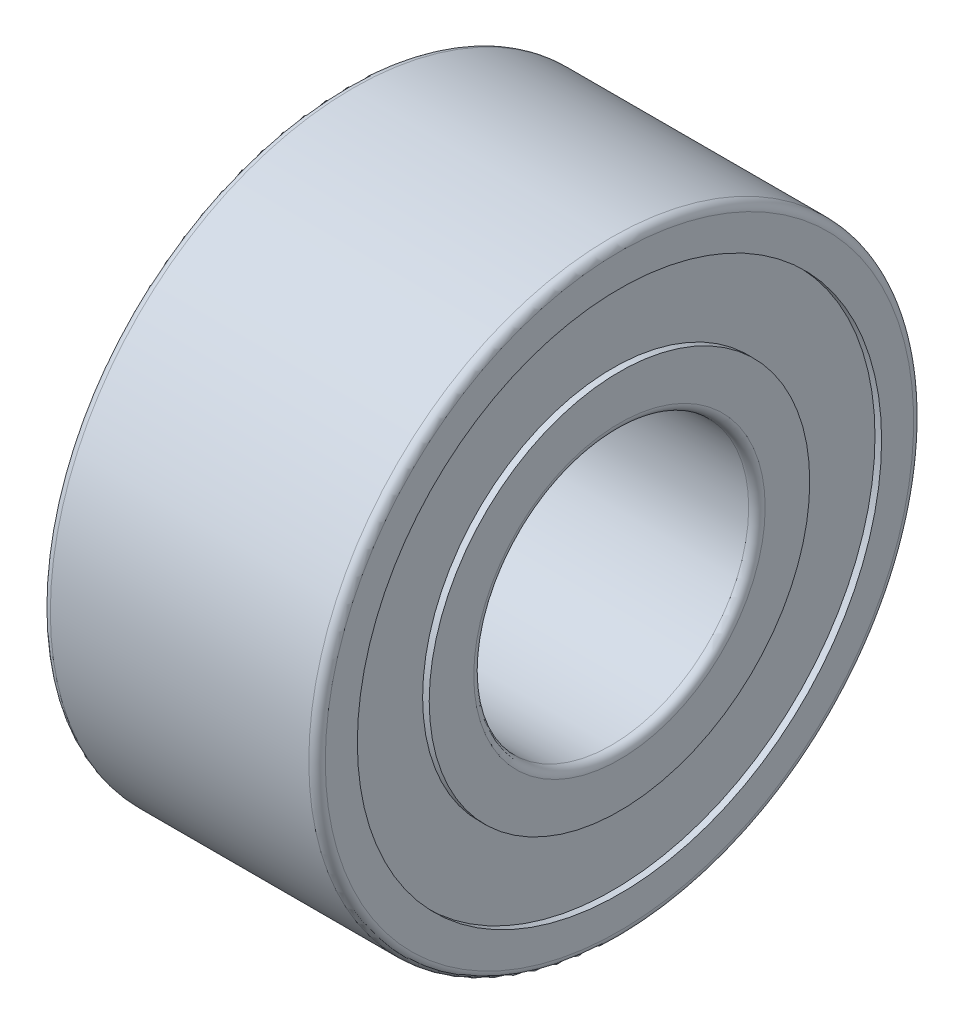
ISO-10303-21;
HEADER;
FILE_DESCRIPTION(('STEP AP214'),'2;1');
FILE_NAME('part.step','',(''),(''),'','','');
FILE_SCHEMA(('AUTOMOTIVE_DESIGN { 1 0 10303 214 1 1 1 1 }'));
ENDSEC;
DATA;
#1=APPLICATION_CONTEXT('core data for automotive mechanical design processes');
#2=APPLICATION_PROTOCOL_DEFINITION('international standard','automotive_design',2000,#1);
#3=PRODUCT_CONTEXT('',#1,'mechanical');
#4=PRODUCT('Part','Part','',(#3));
#5=PRODUCT_RELATED_PRODUCT_CATEGORY('part','',(#4));
#6=PRODUCT_DEFINITION_FORMATION('','',#4);
#7=PRODUCT_DEFINITION_CONTEXT('part definition',#1,'design');
#8=PRODUCT_DEFINITION('design','',#6,#7);
#9=PRODUCT_DEFINITION_SHAPE('','',#8);
#10=(LENGTH_UNIT() NAMED_UNIT(*) SI_UNIT(.MILLI.,.METRE.));
#11=(NAMED_UNIT(*) PLANE_ANGLE_UNIT() SI_UNIT($,.RADIAN.));
#12=(NAMED_UNIT(*) SI_UNIT($,.STERADIAN.) SOLID_ANGLE_UNIT());
#13=UNCERTAINTY_MEASURE_WITH_UNIT(LENGTH_MEASURE(1.E-05),#10,'distance_accuracy_value','');
#14=(GEOMETRIC_REPRESENTATION_CONTEXT(3) GLOBAL_UNCERTAINTY_ASSIGNED_CONTEXT((#13)) GLOBAL_UNIT_ASSIGNED_CONTEXT((#10,
#11,#12)) REPRESENTATION_CONTEXT('',''));
#15=CARTESIAN_POINT('',(0.,0.,0.));
#16=DIRECTION('',(0.,0.,1.));
#17=DIRECTION('',(1.,0.,0.));
#18=AXIS2_PLACEMENT_3D('',#15,#16,#17);
#19=CARTESIAN_POINT('',(0.149999999999969,0.,0.));
#20=DIRECTION('',(-1.,0.,0.));
#21=DIRECTION('',(0.,0.,1.));
#22=AXIS2_PLACEMENT_3D('',#19,#20,#21);
#23=TOROIDAL_SURFACE('',#22,5.35000000000003,0.149999999999969);
#24=CARTESIAN_POINT('',(0.,0.,0.));
#25=DIRECTION('',(-1.,0.,0.));
#26=DIRECTION('',(0.,0.,1.));
#27=AXIS2_PLACEMENT_3D('',#24,#25,#26);
#28=CIRCLE('',#27,5.35);
#29=CARTESIAN_POINT('',(0.,0.,5.35));
#30=VERTEX_POINT('',#29);
#31=EDGE_CURVE('E10',#30,#30,#28,.T.);
#32=ORIENTED_EDGE('',*,*,#31,.F.);
#33=EDGE_LOOP('',(#32));
#34=FACE_BOUND('',#33,.T.);
#35=CARTESIAN_POINT('',(0.15,0.,0.));
#36=DIRECTION('',(-1.,0.,0.));
#37=DIRECTION('',(0.,0.,1.));
#38=AXIS2_PLACEMENT_3D('',#35,#36,#37);
#39=CIRCLE('',#38,5.5);
#40=CARTESIAN_POINT('',(0.15,0.,5.5));
#41=VERTEX_POINT('',#40);
#42=EDGE_CURVE('E81',#41,#41,#39,.T.);
#43=ORIENTED_EDGE('',*,*,#42,.T.);
#44=EDGE_LOOP('',(#43));
#45=FACE_BOUND('',#44,.T.);
#46=ADVANCED_FACE('F29',(#34,#45),#23,.T.);
#47=CARTESIAN_POINT('',(0.,5.35,0.));
#48=DIRECTION('',(1.,0.,0.));
#49=DIRECTION('',(0.,0.,-1.));
#50=AXIS2_PLACEMENT_3D('',#47,#48,#49);
#51=PLANE('',#50);
#52=CARTESIAN_POINT('',(0.,0.,0.));
#53=DIRECTION('',(-1.,0.,0.));
#54=DIRECTION('',(0.,0.,1.));
#55=AXIS2_PLACEMENT_3D('',#52,#53,#54);
#56=CIRCLE('',#55,4.767);
#57=CARTESIAN_POINT('',(0.,0.,4.767));
#58=VERTEX_POINT('',#57);
#59=EDGE_CURVE('E35',#58,#58,#56,.T.);
#60=ORIENTED_EDGE('',*,*,#59,.F.);
#61=EDGE_LOOP('',(#60));
#62=FACE_BOUND('',#61,.T.);
#63=ORIENTED_EDGE('',*,*,#31,.T.);
#64=EDGE_LOOP('',(#63));
#65=FACE_BOUND('',#64,.T.);
#66=ADVANCED_FACE('F166',(#62,#65),#51,.F.);
#67=CARTESIAN_POINT('',(4.85,0.,0.));
#68=DIRECTION('',(-1.,0.,0.));
#69=DIRECTION('',(0.,0.,1.));
#70=AXIS2_PLACEMENT_3D('',#67,#68,#69);
#71=CYLINDRICAL_SURFACE('',#70,4.767);
#72=CARTESIAN_POINT('',(0.12,0.,0.));
#73=DIRECTION('',(-1.,0.,0.));
#74=DIRECTION('',(0.,0.,1.));
#75=AXIS2_PLACEMENT_3D('',#72,#73,#74);
#76=CIRCLE('',#75,4.767);
#77=CARTESIAN_POINT('',(0.12,0.,4.767));
#78=VERTEX_POINT('',#77);
#79=EDGE_CURVE('E39',#78,#78,#76,.T.);
#80=ORIENTED_EDGE('',*,*,#79,.F.);
#81=EDGE_LOOP('',(#80));
#82=FACE_BOUND('',#81,.T.);
#83=ORIENTED_EDGE('',*,*,#59,.T.);
#84=EDGE_LOOP('',(#83));
#85=FACE_BOUND('',#84,.T.);
#86=ADVANCED_FACE('F161',(#82,#85),#71,.F.);
#87=CARTESIAN_POINT('',(0.12,4.767,0.));
#88=DIRECTION('',(1.,0.,0.));
#89=DIRECTION('',(0.,0.,-1.));
#90=AXIS2_PLACEMENT_3D('',#87,#88,#89);
#91=PLANE('',#90);
#92=CARTESIAN_POINT('',(0.12,0.,0.));
#93=DIRECTION('',(-1.,0.,0.));
#94=DIRECTION('',(0.,0.,1.));
#95=AXIS2_PLACEMENT_3D('',#92,#93,#94);
#96=CIRCLE('',#95,3.46);
#97=CARTESIAN_POINT('',(0.12,0.,3.46));
#98=VERTEX_POINT('',#97);
#99=EDGE_CURVE('E43',#98,#98,#96,.T.);
#100=ORIENTED_EDGE('',*,*,#99,.F.);
#101=EDGE_LOOP('',(#100));
#102=FACE_BOUND('',#101,.T.);
#103=ORIENTED_EDGE('',*,*,#79,.T.);
#104=EDGE_LOOP('',(#103));
#105=FACE_BOUND('',#104,.T.);
#106=ADVANCED_FACE('F155',(#102,#105),#91,.F.);
#107=CARTESIAN_POINT('',(4.85,0.,0.));
#108=DIRECTION('',(-1.,0.,0.));
#109=DIRECTION('',(0.,0.,1.));
#110=AXIS2_PLACEMENT_3D('',#107,#108,#109);
#111=CYLINDRICAL_SURFACE('',#110,3.46);
#112=CARTESIAN_POINT('',(0.,0.,0.));
#113=DIRECTION('',(-1.,0.,0.));
#114=DIRECTION('',(0.,0.,1.));
#115=AXIS2_PLACEMENT_3D('',#112,#113,#114);
#116=CIRCLE('',#115,3.46);
#117=CARTESIAN_POINT('',(0.,0.,3.46));
#118=VERTEX_POINT('',#117);
#119=EDGE_CURVE('E48',#118,#118,#116,.T.);
#120=ORIENTED_EDGE('',*,*,#119,.F.);
#121=EDGE_LOOP('',(#120));
#122=FACE_BOUND('',#121,.T.);
#123=ORIENTED_EDGE('',*,*,#99,.T.);
#124=EDGE_LOOP('',(#123));
#125=FACE_BOUND('',#124,.T.);
#126=ADVANCED_FACE('F149',(#122,#125),#111,.T.);
#127=CARTESIAN_POINT('',(0.,3.46,0.));
#128=DIRECTION('',(1.,0.,0.));
#129=DIRECTION('',(0.,0.,-1.));
#130=AXIS2_PLACEMENT_3D('',#127,#128,#129);
#131=PLANE('',#130);
#132=CARTESIAN_POINT('',(0.,0.,0.));
#133=DIRECTION('',(-1.,0.,0.));
#134=DIRECTION('',(0.,0.,1.));
#135=AXIS2_PLACEMENT_3D('',#132,#133,#134);
#136=CIRCLE('',#135,2.65);
#137=CARTESIAN_POINT('',(0.,0.,2.65));
#138=VERTEX_POINT('',#137);
#139=EDGE_CURVE('E51',#138,#138,#136,.T.);
#140=ORIENTED_EDGE('',*,*,#139,.F.);
#141=EDGE_LOOP('',(#140));
#142=FACE_BOUND('',#141,.T.);
#143=ORIENTED_EDGE('',*,*,#119,.T.);
#144=EDGE_LOOP('',(#143));
#145=FACE_BOUND('',#144,.T.);
#146=ADVANCED_FACE('F143',(#142,#145),#131,.F.);
#147=CARTESIAN_POINT('',(0.14999999999997,0.,0.));
#148=DIRECTION('',(-1.,0.,0.));
#149=DIRECTION('',(0.,0.,1.));
#150=AXIS2_PLACEMENT_3D('',#147,#148,#149);
#151=TOROIDAL_SURFACE('',#150,2.64999999999997,0.14999999999997);
#152=CARTESIAN_POINT('',(0.15,0.,0.));
#153=DIRECTION('',(-1.,0.,0.));
#154=DIRECTION('',(0.,0.,1.));
#155=AXIS2_PLACEMENT_3D('',#152,#153,#154);
#156=CIRCLE('',#155,2.5);
#157=CARTESIAN_POINT('',(0.15,0.,2.5));
#158=VERTEX_POINT('',#157);
#159=EDGE_CURVE('E54',#158,#158,#156,.T.);
#160=ORIENTED_EDGE('',*,*,#159,.F.);
#161=EDGE_LOOP('',(#160));
#162=FACE_BOUND('',#161,.T.);
#163=ORIENTED_EDGE('',*,*,#139,.T.);
#164=EDGE_LOOP('',(#163));
#165=FACE_BOUND('',#164,.T.);
#166=ADVANCED_FACE('F137',(#162,#165),#151,.T.);
#167=CARTESIAN_POINT('',(4.85,0.,0.));
#168=DIRECTION('',(-1.,0.,0.));
#169=DIRECTION('',(0.,0.,1.));
#170=AXIS2_PLACEMENT_3D('',#167,#168,#169);
#171=CYLINDRICAL_SURFACE('',#170,2.5);
#172=CARTESIAN_POINT('',(4.85,0.,0.));
#173=DIRECTION('',(-1.,0.,0.));
#174=DIRECTION('',(0.,0.,1.));
#175=AXIS2_PLACEMENT_3D('',#172,#173,#174);
#176=CIRCLE('',#175,2.5);
#177=CARTESIAN_POINT('',(4.85,0.,2.5));
#178=VERTEX_POINT('',#177);
#179=EDGE_CURVE('E57',#178,#178,#176,.T.);
#180=ORIENTED_EDGE('',*,*,#179,.F.);
#181=EDGE_LOOP('',(#180));
#182=FACE_BOUND('',#181,.T.);
#183=ORIENTED_EDGE('',*,*,#159,.T.);
#184=EDGE_LOOP('',(#183));
#185=FACE_BOUND('',#184,.T.);
#186=ADVANCED_FACE('F131',(#182,#185),#171,.F.);
#187=CARTESIAN_POINT('',(4.85000000000006,0.,0.));
#188=DIRECTION('',(-1.,0.,0.));
#189=DIRECTION('',(0.,0.,1.));
#190=AXIS2_PLACEMENT_3D('',#187,#188,#189);
#191=TOROIDAL_SURFACE('',#190,2.64999999999994,0.149999999999939);
#192=CARTESIAN_POINT('',(5.,0.,0.));
#193=DIRECTION('',(-1.,0.,0.));
#194=DIRECTION('',(0.,0.,1.));
#195=AXIS2_PLACEMENT_3D('',#192,#193,#194);
#196=CIRCLE('',#195,2.65);
#197=CARTESIAN_POINT('',(5.,0.,2.65));
#198=VERTEX_POINT('',#197);
#199=EDGE_CURVE('E60',#198,#198,#196,.T.);
#200=ORIENTED_EDGE('',*,*,#199,.F.);
#201=EDGE_LOOP('',(#200));
#202=FACE_BOUND('',#201,.T.);
#203=ORIENTED_EDGE('',*,*,#179,.T.);
#204=EDGE_LOOP('',(#203));
#205=FACE_BOUND('',#204,.T.);
#206=ADVANCED_FACE('F125',(#202,#205),#191,.T.);
#207=CARTESIAN_POINT('',(5.,2.65,0.));
#208=DIRECTION('',(-1.,0.,0.));
#209=DIRECTION('',(0.,0.,1.));
#210=AXIS2_PLACEMENT_3D('',#207,#208,#209);
#211=PLANE('',#210);
#212=CARTESIAN_POINT('',(5.,0.,0.));
#213=DIRECTION('',(-1.,0.,0.));
#214=DIRECTION('',(0.,0.,1.));
#215=AXIS2_PLACEMENT_3D('',#212,#213,#214);
#216=CIRCLE('',#215,3.46);
#217=CARTESIAN_POINT('',(5.,0.,3.46));
#218=VERTEX_POINT('',#217);
#219=EDGE_CURVE('E63',#218,#218,#216,.T.);
#220=ORIENTED_EDGE('',*,*,#219,.F.);
#221=EDGE_LOOP('',(#220));
#222=FACE_BOUND('',#221,.T.);
#223=ORIENTED_EDGE('',*,*,#199,.T.);
#224=EDGE_LOOP('',(#223));
#225=FACE_BOUND('',#224,.T.);
#226=ADVANCED_FACE('F119',(#222,#225),#211,.F.);
#227=CARTESIAN_POINT('',(4.85,0.,0.));
#228=DIRECTION('',(-1.,0.,0.));
#229=DIRECTION('',(0.,0.,1.));
#230=AXIS2_PLACEMENT_3D('',#227,#228,#229);
#231=CYLINDRICAL_SURFACE('',#230,3.46);
#232=CARTESIAN_POINT('',(4.88,0.,0.));
#233=DIRECTION('',(-1.,0.,0.));
#234=DIRECTION('',(0.,0.,1.));
#235=AXIS2_PLACEMENT_3D('',#232,#233,#234);
#236=CIRCLE('',#235,3.46);
#237=CARTESIAN_POINT('',(4.88,0.,3.46));
#238=VERTEX_POINT('',#237);
#239=EDGE_CURVE('E66',#238,#238,#236,.T.);
#240=ORIENTED_EDGE('',*,*,#239,.F.);
#241=EDGE_LOOP('',(#240));
#242=FACE_BOUND('',#241,.T.);
#243=ORIENTED_EDGE('',*,*,#219,.T.);
#244=EDGE_LOOP('',(#243));
#245=FACE_BOUND('',#244,.T.);
#246=ADVANCED_FACE('F113',(#242,#245),#231,.T.);
#247=CARTESIAN_POINT('',(4.88,3.46,0.));
#248=DIRECTION('',(-1.,0.,0.));
#249=DIRECTION('',(0.,0.,1.));
#250=AXIS2_PLACEMENT_3D('',#247,#248,#249);
#251=PLANE('',#250);
#252=CARTESIAN_POINT('',(4.88,0.,0.));
#253=DIRECTION('',(-1.,0.,0.));
#254=DIRECTION('',(0.,0.,1.));
#255=AXIS2_PLACEMENT_3D('',#252,#253,#254);
#256=CIRCLE('',#255,4.767);
#257=CARTESIAN_POINT('',(4.88,0.,4.767));
#258=VERTEX_POINT('',#257);
#259=EDGE_CURVE('E69',#258,#258,#256,.T.);
#260=ORIENTED_EDGE('',*,*,#259,.F.);
#261=EDGE_LOOP('',(#260));
#262=FACE_BOUND('',#261,.T.);
#263=ORIENTED_EDGE('',*,*,#239,.T.);
#264=EDGE_LOOP('',(#263));
#265=FACE_BOUND('',#264,.T.);
#266=ADVANCED_FACE('F107',(#262,#265),#251,.F.);
#267=CARTESIAN_POINT('',(4.85,0.,0.));
#268=DIRECTION('',(-1.,0.,0.));
#269=DIRECTION('',(0.,0.,1.));
#270=AXIS2_PLACEMENT_3D('',#267,#268,#269);
#271=CYLINDRICAL_SURFACE('',#270,4.767);
#272=CARTESIAN_POINT('',(5.,0.,0.));
#273=DIRECTION('',(-1.,0.,0.));
#274=DIRECTION('',(0.,0.,1.));
#275=AXIS2_PLACEMENT_3D('',#272,#273,#274);
#276=CIRCLE('',#275,4.767);
#277=CARTESIAN_POINT('',(5.,0.,4.767));
#278=VERTEX_POINT('',#277);
#279=EDGE_CURVE('E72',#278,#278,#276,.T.);
#280=ORIENTED_EDGE('',*,*,#279,.F.);
#281=EDGE_LOOP('',(#280));
#282=FACE_BOUND('',#281,.T.);
#283=ORIENTED_EDGE('',*,*,#259,.T.);
#284=EDGE_LOOP('',(#283));
#285=FACE_BOUND('',#284,.T.);
#286=ADVANCED_FACE('F101',(#282,#285),#271,.F.);
#287=CARTESIAN_POINT('',(5.,4.767,0.));
#288=DIRECTION('',(-1.,0.,0.));
#289=DIRECTION('',(0.,0.,1.));
#290=AXIS2_PLACEMENT_3D('',#287,#288,#289);
#291=PLANE('',#290);
#292=CARTESIAN_POINT('',(5.,0.,0.));
#293=DIRECTION('',(-1.,0.,0.));
#294=DIRECTION('',(0.,0.,1.));
#295=AXIS2_PLACEMENT_3D('',#292,#293,#294);
#296=CIRCLE('',#295,5.35);
#297=CARTESIAN_POINT('',(5.,0.,5.35));
#298=VERTEX_POINT('',#297);
#299=EDGE_CURVE('E75',#298,#298,#296,.T.);
#300=ORIENTED_EDGE('',*,*,#299,.F.);
#301=EDGE_LOOP('',(#300));
#302=FACE_BOUND('',#301,.T.);
#303=ORIENTED_EDGE('',*,*,#279,.T.);
#304=EDGE_LOOP('',(#303));
#305=FACE_BOUND('',#304,.T.);
#306=ADVANCED_FACE('F95',(#302,#305),#291,.F.);
#307=CARTESIAN_POINT('',(4.85000000000006,0.,0.));
#308=DIRECTION('',(-1.,0.,0.));
#309=DIRECTION('',(0.,0.,1.));
#310=AXIS2_PLACEMENT_3D('',#307,#308,#309);
#311=TOROIDAL_SURFACE('',#310,5.35000000000006,0.149999999999938);
#312=CARTESIAN_POINT('',(4.85,0.,0.));
#313=DIRECTION('',(-1.,0.,0.));
#314=DIRECTION('',(0.,0.,1.));
#315=AXIS2_PLACEMENT_3D('',#312,#313,#314);
#316=CIRCLE('',#315,5.5);
#317=CARTESIAN_POINT('',(4.85,0.,5.5));
#318=VERTEX_POINT('',#317);
#319=EDGE_CURVE('E78',#318,#318,#316,.T.);
#320=ORIENTED_EDGE('',*,*,#319,.F.);
#321=EDGE_LOOP('',(#320));
#322=FACE_BOUND('',#321,.T.);
#323=ORIENTED_EDGE('',*,*,#299,.T.);
#324=EDGE_LOOP('',(#323));
#325=FACE_BOUND('',#324,.T.);
#326=ADVANCED_FACE('F89',(#322,#325),#311,.T.);
#327=CARTESIAN_POINT('',(4.85,0.,0.));
#328=DIRECTION('',(-1.,0.,0.));
#329=DIRECTION('',(0.,0.,1.));
#330=AXIS2_PLACEMENT_3D('',#327,#328,#329);
#331=CYLINDRICAL_SURFACE('',#330,5.5);
#332=ORIENTED_EDGE('',*,*,#42,.F.);
#333=EDGE_LOOP('',(#332));
#334=FACE_BOUND('',#333,.T.);
#335=ORIENTED_EDGE('',*,*,#319,.T.);
#336=EDGE_LOOP('',(#335));
#337=FACE_BOUND('',#336,.T.);
#338=ADVANCED_FACE('F86',(#334,#337),#331,.T.);
#339=CLOSED_SHELL('',(#46,#66,#86,#106,#126,#146,#166,#186,#206,#226,#246,#266,#286,#306,#326,#338));
#340=MANIFOLD_SOLID_BREP('B2',#339);
#341=ADVANCED_BREP_SHAPE_REPRESENTATION('',(#18,#340),#14);
#342=SHAPE_DEFINITION_REPRESENTATION(#9,#341);
ENDSEC;
END-ISO-10303-21;
